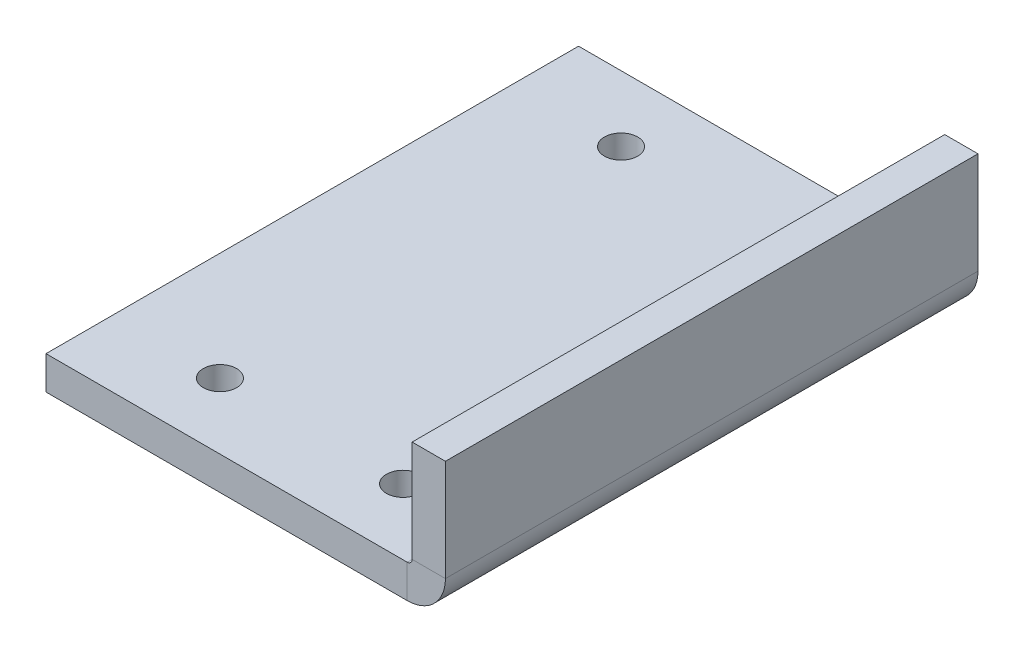
ISO-10303-21;
HEADER;
FILE_DESCRIPTION(('STEP AP214'),'2;1');
FILE_NAME('part.step','',(''),(''),'','','');
FILE_SCHEMA(('AUTOMOTIVE_DESIGN { 1 0 10303 214 1 1 1 1 }'));
ENDSEC;
DATA;
#1=APPLICATION_CONTEXT('core data for automotive mechanical design processes');
#2=APPLICATION_PROTOCOL_DEFINITION('international standard','automotive_design',2000,#1);
#3=PRODUCT_CONTEXT('',#1,'mechanical');
#4=PRODUCT('Part','Part','',(#3));
#5=PRODUCT_RELATED_PRODUCT_CATEGORY('part','',(#4));
#6=PRODUCT_DEFINITION_FORMATION('','',#4);
#7=PRODUCT_DEFINITION_CONTEXT('part definition',#1,'design');
#8=PRODUCT_DEFINITION('design','',#6,#7);
#9=PRODUCT_DEFINITION_SHAPE('','',#8);
#10=(LENGTH_UNIT() NAMED_UNIT(*) SI_UNIT(.MILLI.,.METRE.));
#11=(NAMED_UNIT(*) PLANE_ANGLE_UNIT() SI_UNIT($,.RADIAN.));
#12=(NAMED_UNIT(*) SI_UNIT($,.STERADIAN.) SOLID_ANGLE_UNIT());
#13=UNCERTAINTY_MEASURE_WITH_UNIT(LENGTH_MEASURE(1.E-05),#10,'distance_accuracy_value','');
#14=(GEOMETRIC_REPRESENTATION_CONTEXT(3) GLOBAL_UNCERTAINTY_ASSIGNED_CONTEXT((#13)) GLOBAL_UNIT_ASSIGNED_CONTEXT((#10,
#11,#12)) REPRESENTATION_CONTEXT('',''));
#15=CARTESIAN_POINT('',(0.,0.,0.));
#16=DIRECTION('',(0.,0.,1.));
#17=DIRECTION('',(1.,0.,0.));
#18=AXIS2_PLACEMENT_3D('',#15,#16,#17);
#19=CARTESIAN_POINT('',(-29.9999999999989,-5.00000000000095,-39.9999999999988));
#20=DIRECTION('',(0.,0.,-1.));
#21=DIRECTION('',(-1.,0.,0.));
#22=AXIS2_PLACEMENT_3D('',#19,#20,#21);
#23=PLANE('',#22);
#24=DIRECTION('',(-1.,0.,0.));
#25=VECTOR('',#24,1.);
#26=CARTESIAN_POINT('',(-29.9999999999998,-6.66133814775094E-13,-39.9999999999994));
#27=LINE('',#26,#25);
#28=CARTESIAN_POINT('',(24.2634000000021,-1.72084568816899E-12,-39.9999999999979));
#29=VERTEX_POINT('',#28);
#30=CARTESIAN_POINT('',(-29.9999999999998,-6.66133814775094E-13,-39.9999999999994));
#31=VERTEX_POINT('',#30);
#32=EDGE_CURVE('E110',#29,#31,#27,.T.);
#33=ORIENTED_EDGE('',*,*,#32,.F.);
#34=DIRECTION('',(0.,-0.999999999999999,0.));
#35=VECTOR('',#34,1.);
#36=CARTESIAN_POINT('',(24.2634000000021,-1.72084568816899E-12,-39.9999999999979));
#37=LINE('',#36,#35);
#38=CARTESIAN_POINT('',(24.2633999999999,-5.00000000000023,-40.0000000000001));
#39=VERTEX_POINT('',#38);
#40=EDGE_CURVE('E123',#29,#39,#37,.T.);
#41=ORIENTED_EDGE('',*,*,#40,.T.);
#42=DIRECTION('',(-1.,0.,0.));
#43=VECTOR('',#42,1.);
#44=CARTESIAN_POINT('',(-29.9999999999989,-5.00000000000095,-39.9999999999988));
#45=LINE('',#44,#43);
#46=CARTESIAN_POINT('',(-29.9999999999989,-5.00000000000095,-39.9999999999988));
#47=VERTEX_POINT('',#46);
#48=EDGE_CURVE('E115',#39,#47,#45,.T.);
#49=ORIENTED_EDGE('',*,*,#48,.T.);
#50=DIRECTION('',(0.,0.999999999999999,0.));
#51=VECTOR('',#50,1.);
#52=CARTESIAN_POINT('',(-29.9999999999989,-5.00000000000095,-39.9999999999988));
#53=LINE('',#52,#51);
#54=EDGE_CURVE('E65',#47,#31,#53,.T.);
#55=ORIENTED_EDGE('',*,*,#54,.T.);
#56=EDGE_LOOP('',(#33,#41,#49,#55));
#57=FACE_BOUND('',#56,.T.);
#58=ADVANCED_FACE('F62',(#57),#23,.T.);
#59=CARTESIAN_POINT('',(6.10622663543836E-13,-5.00000000000056,9.43689570931383E-13));
#60=DIRECTION('',(0.,-0.999999999999999,0.));
#61=DIRECTION('',(0.,0.,-1.));
#62=AXIS2_PLACEMENT_3D('',#59,#60,#61);
#63=PLANE('',#62);
#64=CARTESIAN_POINT('',(-13.7499999999984,-5.00000000000123,30.1200000000032));
#65=DIRECTION('',(0.,-0.999999999999999,0.));
#66=DIRECTION('',(0.,0.,-1.));
#67=AXIS2_PLACEMENT_3D('',#64,#65,#66);
#68=CIRCLE('',#67,2.5);
#69=CARTESIAN_POINT('',(-13.7499999999984,-5.00000000000123,27.6200000000032));
#70=VERTEX_POINT('',#69);
#71=EDGE_CURVE('E185',#70,#70,#68,.F.);
#72=ORIENTED_EDGE('',*,*,#71,.T.);
#73=EDGE_LOOP('',(#72));
#74=FACE_BOUND('',#73,.T.);
#75=CARTESIAN_POINT('',(13.7500000000019,-5.00000000000089,30.1200000000029));
#76=DIRECTION('',(0.,-0.999999999999999,0.));
#77=DIRECTION('',(0.,0.,-1.));
#78=AXIS2_PLACEMENT_3D('',#75,#76,#77);
#79=CIRCLE('',#78,2.5);
#80=CARTESIAN_POINT('',(13.7500000000019,-5.00000000000089,27.6200000000029));
#81=VERTEX_POINT('',#80);
#82=EDGE_CURVE('E192',#81,#81,#79,.F.);
#83=ORIENTED_EDGE('',*,*,#82,.T.);
#84=EDGE_LOOP('',(#83));
#85=FACE_BOUND('',#84,.T.);
#86=CARTESIAN_POINT('',(13.7500000000009,-5.00000000000139,-30.1299999999975));
#87=DIRECTION('',(0.,-0.999999999999999,0.));
#88=DIRECTION('',(0.,0.,-1.));
#89=AXIS2_PLACEMENT_3D('',#86,#87,#88);
#90=CIRCLE('',#89,2.5);
#91=CARTESIAN_POINT('',(13.7500000000009,-5.00000000000139,-32.6299999999976));
#92=VERTEX_POINT('',#91);
#93=EDGE_CURVE('E184',#92,#92,#90,.F.);
#94=ORIENTED_EDGE('',*,*,#93,.T.);
#95=EDGE_LOOP('',(#94));
#96=FACE_BOUND('',#95,.T.);
#97=CARTESIAN_POINT('',(-13.7500000000001,-5.00000000000067,-30.1299999999994));
#98=DIRECTION('',(0.,-0.999999999999999,0.));
#99=DIRECTION('',(0.,0.,-1.));
#100=AXIS2_PLACEMENT_3D('',#97,#98,#99);
#101=CIRCLE('',#100,2.5);
#102=CARTESIAN_POINT('',(-13.7500000000001,-5.00000000000067,-32.6299999999994));
#103=VERTEX_POINT('',#102);
#104=EDGE_CURVE('E148',#103,#103,#101,.F.);
#105=ORIENTED_EDGE('',*,*,#104,.T.);
#106=EDGE_LOOP('',(#105));
#107=FACE_BOUND('',#106,.T.);
#108=ORIENTED_EDGE('',*,*,#48,.F.);
#109=DIRECTION('',(0.,0.,-1.));
#110=VECTOR('',#109,1.);
#111=CARTESIAN_POINT('',(24.2633999999999,-5.00000000000023,-40.0000000000001));
#112=LINE('',#111,#110);
#113=CARTESIAN_POINT('',(24.2634000000007,-5.00000000000134,40.0000000000032));
#114=VERTEX_POINT('',#113);
#115=EDGE_CURVE('E140',#39,#114,#112,.F.);
#116=ORIENTED_EDGE('',*,*,#115,.T.);
#117=DIRECTION('',(1.,0.,0.));
#118=VECTOR('',#117,1.);
#119=CARTESIAN_POINT('',(-29.9999999999977,-5.00000000000111,40.0000000000027));
#120=LINE('',#119,#118);
#121=CARTESIAN_POINT('',(-29.9999999999977,-5.00000000000111,40.0000000000027));
#122=VERTEX_POINT('',#121);
#123=EDGE_CURVE('E120',#122,#114,#120,.T.);
#124=ORIENTED_EDGE('',*,*,#123,.F.);
#125=DIRECTION('',(0.,0.,1.));
#126=VECTOR('',#125,1.);
#127=CARTESIAN_POINT('',(-29.9999999999977,-5.00000000000111,40.0000000000027));
#128=LINE('',#127,#126);
#129=EDGE_CURVE('E100',#47,#122,#128,.T.);
#130=ORIENTED_EDGE('',*,*,#129,.F.);
#131=EDGE_LOOP('',(#108,#116,#124,#130));
#132=FACE_BOUND('',#131,.T.);
#133=ADVANCED_FACE('F208',(#74,#85,#96,#107,#132),#63,.T.);
#134=CARTESIAN_POINT('',(0.,0.,0.));
#135=DIRECTION('',(0.,-0.999999999999999,0.));
#136=DIRECTION('',(0.,0.,-1.));
#137=AXIS2_PLACEMENT_3D('',#134,#135,#136);
#138=PLANE('',#137);
#139=CARTESIAN_POINT('',(-13.7499999999982,-1.16573417585641E-12,30.1200000000032));
#140=DIRECTION('',(0.,0.999999999999999,0.));
#141=DIRECTION('',(0.,0.,1.));
#142=AXIS2_PLACEMENT_3D('',#139,#140,#141);
#143=CIRCLE('',#142,2.5);
#144=CARTESIAN_POINT('',(-13.7499999999982,-1.16504028646602E-12,32.6200000000032));
#145=VERTEX_POINT('',#144);
#146=EDGE_CURVE('E189',#145,#145,#143,.T.);
#147=ORIENTED_EDGE('',*,*,#146,.F.);
#148=EDGE_LOOP('',(#147));
#149=FACE_BOUND('',#148,.T.);
#150=CARTESIAN_POINT('',(13.7500000000018,-1.22124532708767E-12,30.120000000003));
#151=DIRECTION('',(0.,0.999999999999999,0.));
#152=DIRECTION('',(0.,0.,1.));
#153=AXIS2_PLACEMENT_3D('',#150,#151,#152);
#154=CIRCLE('',#153,2.5);
#155=CARTESIAN_POINT('',(13.7500000000018,-1.22055143769728E-12,32.620000000003));
#156=VERTEX_POINT('',#155);
#157=EDGE_CURVE('E188',#156,#156,#154,.T.);
#158=ORIENTED_EDGE('',*,*,#157,.F.);
#159=EDGE_LOOP('',(#158));
#160=FACE_BOUND('',#159,.T.);
#161=CARTESIAN_POINT('',(13.7500000000003,-8.32667268468867E-13,-30.1299999999997));
#162=DIRECTION('',(0.,0.999999999999999,0.));
#163=DIRECTION('',(0.,0.,1.));
#164=AXIS2_PLACEMENT_3D('',#161,#162,#163);
#165=CIRCLE('',#164,2.5);
#166=CARTESIAN_POINT('',(13.7500000000003,-8.31973379078477E-13,-27.6299999999997));
#167=VERTEX_POINT('',#166);
#168=EDGE_CURVE('E195',#167,#167,#165,.T.);
#169=ORIENTED_EDGE('',*,*,#168,.F.);
#170=EDGE_LOOP('',(#169));
#171=FACE_BOUND('',#170,.T.);
#172=CARTESIAN_POINT('',(-13.75,-7.21644966006352E-13,-30.1299999999993));
#173=DIRECTION('',(0.,0.999999999999999,0.));
#174=DIRECTION('',(0.,0.,1.));
#175=AXIS2_PLACEMENT_3D('',#172,#173,#174);
#176=CIRCLE('',#175,2.5);
#177=CARTESIAN_POINT('',(-13.75,-7.20951076615961E-13,-27.6299999999993));
#178=VERTEX_POINT('',#177);
#179=EDGE_CURVE('E181',#178,#178,#176,.T.);
#180=ORIENTED_EDGE('',*,*,#179,.F.);
#181=EDGE_LOOP('',(#180));
#182=FACE_BOUND('',#181,.T.);
#183=DIRECTION('',(0.,0.,-1.));
#184=VECTOR('',#183,1.);
#185=CARTESIAN_POINT('',(24.2634000000021,-1.72084568816899E-12,-39.9999999999979));
#186=LINE('',#185,#184);
#187=CARTESIAN_POINT('',(24.2634000000001,-7.7715611723761E-13,40.0000000000017));
#188=VERTEX_POINT('',#187);
#189=EDGE_CURVE('E130',#29,#188,#186,.F.);
#190=ORIENTED_EDGE('',*,*,#189,.F.);
#191=ORIENTED_EDGE('',*,*,#32,.T.);
#192=DIRECTION('',(0.,0.,1.));
#193=VECTOR('',#192,1.);
#194=CARTESIAN_POINT('',(-29.9999999999986,-1.55431223447522E-12,40.000000000003));
#195=LINE('',#194,#193);
#196=CARTESIAN_POINT('',(-29.9999999999986,-1.55431223447522E-12,40.000000000003));
#197=VERTEX_POINT('',#196);
#198=EDGE_CURVE('E98',#31,#197,#195,.T.);
#199=ORIENTED_EDGE('',*,*,#198,.T.);
#200=DIRECTION('',(1.,0.,0.));
#201=VECTOR('',#200,1.);
#202=CARTESIAN_POINT('',(-29.9999999999986,-1.55431223447522E-12,40.000000000003));
#203=LINE('',#202,#201);
#204=EDGE_CURVE('E107',#197,#188,#203,.T.);
#205=ORIENTED_EDGE('',*,*,#204,.T.);
#206=EDGE_LOOP('',(#190,#191,#199,#205));
#207=FACE_BOUND('',#206,.T.);
#208=ADVANCED_FACE('F105',(#149,#160,#171,#182,#207),#138,.F.);
#209=CARTESIAN_POINT('',(-29.9999999999977,-5.00000000000111,40.0000000000027));
#210=DIRECTION('',(0.,0.,1.));
#211=DIRECTION('',(1.,0.,0.));
#212=AXIS2_PLACEMENT_3D('',#209,#210,#211);
#213=PLANE('',#212);
#214=DIRECTION('',(0.,-0.999999999999999,0.));
#215=VECTOR('',#214,1.);
#216=CARTESIAN_POINT('',(24.2634000000001,-7.7715611723761E-13,40.0000000000017));
#217=LINE('',#216,#215);
#218=EDGE_CURVE('E114',#188,#114,#217,.T.);
#219=ORIENTED_EDGE('',*,*,#218,.F.);
#220=ORIENTED_EDGE('',*,*,#204,.F.);
#221=DIRECTION('',(0.,0.999999999999999,0.));
#222=VECTOR('',#221,1.);
#223=CARTESIAN_POINT('',(-29.9999999999977,-5.00000000000111,40.0000000000027));
#224=LINE('',#223,#222);
#225=EDGE_CURVE('E13',#122,#197,#224,.T.);
#226=ORIENTED_EDGE('',*,*,#225,.F.);
#227=ORIENTED_EDGE('',*,*,#123,.T.);
#228=EDGE_LOOP('',(#219,#220,#226,#227));
#229=FACE_BOUND('',#228,.T.);
#230=ADVANCED_FACE('F113',(#229),#213,.T.);
#231=CARTESIAN_POINT('',(-29.9999999999977,-5.00000000000111,40.0000000000027));
#232=DIRECTION('',(-1.,0.,0.));
#233=DIRECTION('',(0.,0.,1.));
#234=AXIS2_PLACEMENT_3D('',#231,#232,#233);
#235=PLANE('',#234);
#236=ORIENTED_EDGE('',*,*,#198,.F.);
#237=ORIENTED_EDGE('',*,*,#54,.F.);
#238=ORIENTED_EDGE('',*,*,#129,.T.);
#239=ORIENTED_EDGE('',*,*,#225,.T.);
#240=EDGE_LOOP('',(#236,#237,#238,#239));
#241=FACE_BOUND('',#240,.T.);
#242=ADVANCED_FACE('F96',(#241),#235,.T.);
#243=CARTESIAN_POINT('',(24.2634000000013,0.736599999999088,40.0000000000024));
#244=DIRECTION('',(0.,0.,1.));
#245=DIRECTION('',(1.,0.,0.));
#246=AXIS2_PLACEMENT_3D('',#243,#244,#245);
#247=PLANE('',#246);
#248=DIRECTION('',(-1.,0.,0.));
#249=VECTOR('',#248,1.);
#250=CARTESIAN_POINT('',(30.000000000001,0.736599999998644,40.0000000000033));
#251=LINE('',#250,#249);
#252=CARTESIAN_POINT('',(25.0000000000007,0.736599999999532,40.0000000000009));
#253=VERTEX_POINT('',#252);
#254=CARTESIAN_POINT('',(30.000000000001,0.736599999998644,40.0000000000033));
#255=VERTEX_POINT('',#254);
#256=EDGE_CURVE('E144',#253,#255,#251,.F.);
#257=ORIENTED_EDGE('',*,*,#256,.F.);
#258=CARTESIAN_POINT('',(24.2634000000013,0.736599999999088,40.0000000000024));
#259=DIRECTION('',(0.,0.,-1.));
#260=DIRECTION('',(-1.,0.,0.));
#261=AXIS2_PLACEMENT_3D('',#258,#259,#260);
#262=CIRCLE('',#261,0.7366);
#263=EDGE_CURVE('E134',#188,#253,#262,.F.);
#264=ORIENTED_EDGE('',*,*,#263,.F.);
#265=ORIENTED_EDGE('',*,*,#218,.T.);
#266=CARTESIAN_POINT('',(24.2634000000013,0.736599999999088,40.0000000000024));
#267=DIRECTION('',(0.,0.,-1.));
#268=DIRECTION('',(-1.,0.,0.));
#269=AXIS2_PLACEMENT_3D('',#266,#267,#268);
#270=CIRCLE('',#269,5.7366);
#271=EDGE_CURVE('E76',#114,#255,#270,.F.);
#272=ORIENTED_EDGE('',*,*,#271,.T.);
#273=EDGE_LOOP('',(#257,#264,#265,#272));
#274=FACE_BOUND('',#273,.T.);
#275=ADVANCED_FACE('F272',(#274),#247,.T.);
#276=CARTESIAN_POINT('',(24.2634000000009,0.736599999999255,-39.9999999999993));
#277=DIRECTION('',(0.,0.,1.));
#278=DIRECTION('',(1.,0.,0.));
#279=AXIS2_PLACEMENT_3D('',#276,#277,#278);
#280=PLANE('',#279);
#281=CARTESIAN_POINT('',(24.2634000000009,0.736599999999255,-39.9999999999993));
#282=DIRECTION('',(0.,0.,-1.));
#283=DIRECTION('',(-1.,0.,0.));
#284=AXIS2_PLACEMENT_3D('',#281,#282,#283);
#285=CIRCLE('',#284,0.7366);
#286=CARTESIAN_POINT('',(25.0000000000026,0.736599999998089,-39.9999999999983));
#287=VERTEX_POINT('',#286);
#288=EDGE_CURVE('E127',#287,#29,#285,.T.);
#289=ORIENTED_EDGE('',*,*,#288,.F.);
#290=DIRECTION('',(-1.,0.,0.));
#291=VECTOR('',#290,1.);
#292=CARTESIAN_POINT('',(25.0000000000026,0.736599999998089,-39.9999999999983));
#293=LINE('',#292,#291);
#294=CARTESIAN_POINT('',(30.0000000000004,0.736599999999477,-39.9999999999995));
#295=VERTEX_POINT('',#294);
#296=EDGE_CURVE('E151',#287,#295,#293,.F.);
#297=ORIENTED_EDGE('',*,*,#296,.T.);
#298=CARTESIAN_POINT('',(24.2634000000009,0.736599999999255,-39.9999999999993));
#299=DIRECTION('',(0.,0.,-1.));
#300=DIRECTION('',(-1.,0.,0.));
#301=AXIS2_PLACEMENT_3D('',#298,#299,#300);
#302=CIRCLE('',#301,5.7366);
#303=EDGE_CURVE('E137',#295,#39,#302,.T.);
#304=ORIENTED_EDGE('',*,*,#303,.T.);
#305=ORIENTED_EDGE('',*,*,#40,.F.);
#306=EDGE_LOOP('',(#289,#297,#304,#305));
#307=FACE_BOUND('',#306,.T.);
#308=ADVANCED_FACE('F232',(#307),#280,.F.);
#309=CARTESIAN_POINT('',(24.2634000000009,0.736599999999255,-39.9999999999993));
#310=DIRECTION('',(0.,0.,-1.));
#311=DIRECTION('',(1.,0.,0.));
#312=AXIS2_PLACEMENT_3D('',#309,#310,#311);
#313=CYLINDRICAL_SURFACE('',#312,5.7366);
#314=ORIENTED_EDGE('',*,*,#115,.F.);
#315=ORIENTED_EDGE('',*,*,#303,.F.);
#316=DIRECTION('',(0.,0.,-1.));
#317=VECTOR('',#316,1.);
#318=CARTESIAN_POINT('',(30.000000000001,0.736599999998644,40.0000000000033));
#319=LINE('',#318,#317);
#320=EDGE_CURVE('E154',#295,#255,#319,.F.);
#321=ORIENTED_EDGE('',*,*,#320,.T.);
#322=ORIENTED_EDGE('',*,*,#271,.F.);
#323=EDGE_LOOP('',(#314,#315,#321,#322));
#324=FACE_BOUND('',#323,.T.);
#325=ADVANCED_FACE('F269',(#324),#313,.T.);
#326=CARTESIAN_POINT('',(24.2634000000009,0.736599999999255,-39.9999999999993));
#327=DIRECTION('',(0.,0.,-1.));
#328=DIRECTION('',(1.,0.,0.));
#329=AXIS2_PLACEMENT_3D('',#326,#327,#328);
#330=CYLINDRICAL_SURFACE('',#329,0.7366);
#331=ORIENTED_EDGE('',*,*,#189,.T.);
#332=ORIENTED_EDGE('',*,*,#263,.T.);
#333=DIRECTION('',(0.,0.,-1.));
#334=VECTOR('',#333,1.);
#335=CARTESIAN_POINT('',(25.0000000000007,0.736599999999532,40.0000000000009));
#336=LINE('',#335,#334);
#337=EDGE_CURVE('E147',#253,#287,#336,.T.);
#338=ORIENTED_EDGE('',*,*,#337,.T.);
#339=ORIENTED_EDGE('',*,*,#288,.T.);
#340=EDGE_LOOP('',(#331,#332,#338,#339));
#341=FACE_BOUND('',#340,.T.);
#342=ADVANCED_FACE('F238',(#341),#330,.F.);
#343=CARTESIAN_POINT('',(30.0000000000017,-1.33226762955019E-12,40.0000000000026));
#344=DIRECTION('',(0.,0.,-1.));
#345=DIRECTION('',(-1.,0.,0.));
#346=AXIS2_PLACEMENT_3D('',#343,#344,#345);
#347=PLANE('',#346);
#348=ORIENTED_EDGE('',*,*,#256,.T.);
#349=DIRECTION('',(0.,-1.,0.));
#350=VECTOR('',#349,1.);
#351=CARTESIAN_POINT('',(30.0000000000015,-1.60982338570648E-12,40.0000000000032));
#352=LINE('',#351,#350);
#353=CARTESIAN_POINT('',(30.0000000000012,15.9999999999993,40.000000000001));
#354=VERTEX_POINT('',#353);
#355=EDGE_CURVE('E165',#354,#255,#352,.T.);
#356=ORIENTED_EDGE('',*,*,#355,.F.);
#357=DIRECTION('',(-1.,0.,0.));
#358=VECTOR('',#357,1.);
#359=CARTESIAN_POINT('',(30.0000000000012,15.9999999999993,40.000000000001));
#360=LINE('',#359,#358);
#361=CARTESIAN_POINT('',(25.000000000001,15.9999999999988,40.0000000000031));
#362=VERTEX_POINT('',#361);
#363=EDGE_CURVE('E174',#354,#362,#360,.T.);
#364=ORIENTED_EDGE('',*,*,#363,.T.);
#365=DIRECTION('',(0.,1.,0.));
#366=VECTOR('',#365,1.);
#367=CARTESIAN_POINT('',(25.0000000000009,-1.66533453693773E-12,40.0000000000034));
#368=LINE('',#367,#366);
#369=EDGE_CURVE('E156',#362,#253,#368,.F.);
#370=ORIENTED_EDGE('',*,*,#369,.T.);
#371=EDGE_LOOP('',(#348,#356,#364,#370));
#372=FACE_BOUND('',#371,.T.);
#373=ADVANCED_FACE('F252',(#372),#347,.F.);
#374=CARTESIAN_POINT('',(30.0000000000007,15.9999999999991,-39.9999999999993));
#375=DIRECTION('',(0.,0.,1.));
#376=DIRECTION('',(1.,0.,0.));
#377=AXIS2_PLACEMENT_3D('',#374,#375,#376);
#378=PLANE('',#377);
#379=ORIENTED_EDGE('',*,*,#296,.F.);
#380=DIRECTION('',(0.,-1.,0.));
#381=VECTOR('',#380,1.);
#382=CARTESIAN_POINT('',(25.0000000000015,15.9999999999986,-39.9999999999977));
#383=LINE('',#382,#381);
#384=CARTESIAN_POINT('',(25.0000000000015,15.9999999999986,-39.9999999999977));
#385=VERTEX_POINT('',#384);
#386=EDGE_CURVE('E159',#287,#385,#383,.F.);
#387=ORIENTED_EDGE('',*,*,#386,.T.);
#388=DIRECTION('',(-1.,0.,0.));
#389=VECTOR('',#388,1.);
#390=CARTESIAN_POINT('',(30.0000000000007,15.9999999999991,-39.9999999999993));
#391=LINE('',#390,#389);
#392=CARTESIAN_POINT('',(30.0000000000007,15.9999999999991,-39.9999999999993));
#393=VERTEX_POINT('',#392);
#394=EDGE_CURVE('E131',#393,#385,#391,.T.);
#395=ORIENTED_EDGE('',*,*,#394,.F.);
#396=DIRECTION('',(0.,1.,0.));
#397=VECTOR('',#396,1.);
#398=CARTESIAN_POINT('',(30.0000000000006,-3.33066907387547E-13,-39.9999999999998));
#399=LINE('',#398,#397);
#400=EDGE_CURVE('E168',#295,#393,#399,.T.);
#401=ORIENTED_EDGE('',*,*,#400,.F.);
#402=EDGE_LOOP('',(#379,#387,#395,#401));
#403=FACE_BOUND('',#402,.T.);
#404=ADVANCED_FACE('F343',(#403),#378,.F.);
#405=CARTESIAN_POINT('',(30.0000000000011,-1.16573417585641E-12,2.1094237467878E-12));
#406=DIRECTION('',(-1.,0.,0.));
#407=DIRECTION('',(0.,-1.,0.));
#408=AXIS2_PLACEMENT_3D('',#405,#406,#407);
#409=PLANE('',#408);
#410=ORIENTED_EDGE('',*,*,#320,.F.);
#411=ORIENTED_EDGE('',*,*,#400,.T.);
#412=DIRECTION('',(0.,0.,1.));
#413=VECTOR('',#412,1.);
#414=CARTESIAN_POINT('',(30.0000000000015,15.9999999999983,3.05311331771918E-12));
#415=LINE('',#414,#413);
#416=EDGE_CURVE('E171',#393,#354,#415,.T.);
#417=ORIENTED_EDGE('',*,*,#416,.T.);
#418=ORIENTED_EDGE('',*,*,#355,.T.);
#419=EDGE_LOOP('',(#410,#411,#417,#418));
#420=FACE_BOUND('',#419,.T.);
#421=ADVANCED_FACE('F353',(#420),#409,.F.);
#422=CARTESIAN_POINT('',(25.0000000000021,-1.55431223447522E-12,2.77555756156289E-12));
#423=DIRECTION('',(-1.,0.,0.));
#424=DIRECTION('',(0.,-1.,0.));
#425=AXIS2_PLACEMENT_3D('',#422,#423,#424);
#426=PLANE('',#425);
#427=ORIENTED_EDGE('',*,*,#386,.F.);
#428=ORIENTED_EDGE('',*,*,#337,.F.);
#429=ORIENTED_EDGE('',*,*,#369,.F.);
#430=DIRECTION('',(0.,0.,-1.));
#431=VECTOR('',#430,1.);
#432=CARTESIAN_POINT('',(25.000000000001,15.9999999999988,40.0000000000031));
#433=LINE('',#432,#431);
#434=EDGE_CURVE('E162',#385,#362,#433,.F.);
#435=ORIENTED_EDGE('',*,*,#434,.F.);
#436=EDGE_LOOP('',(#427,#428,#429,#435));
#437=FACE_BOUND('',#436,.T.);
#438=ADVANCED_FACE('F245',(#437),#426,.T.);
#439=CARTESIAN_POINT('',(30.0000000000012,15.9999999999993,40.000000000001));
#440=DIRECTION('',(0.,-1.,0.));
#441=DIRECTION('',(1.,0.,0.));
#442=AXIS2_PLACEMENT_3D('',#439,#440,#441);
#443=PLANE('',#442);
#444=ORIENTED_EDGE('',*,*,#434,.T.);
#445=ORIENTED_EDGE('',*,*,#363,.F.);
#446=ORIENTED_EDGE('',*,*,#416,.F.);
#447=ORIENTED_EDGE('',*,*,#394,.T.);
#448=EDGE_LOOP('',(#444,#445,#446,#447));
#449=FACE_BOUND('',#448,.T.);
#450=ADVANCED_FACE('F216',(#449),#443,.F.);
#451=CARTESIAN_POINT('',(-13.7499999999988,-12.0710678118661,-30.1299999999986));
#452=DIRECTION('',(0.,0.999999999999999,0.));
#453=DIRECTION('',(0.,0.,1.));
#454=AXIS2_PLACEMENT_3D('',#451,#452,#453);
#455=CYLINDRICAL_SURFACE('',#454,2.5);
#456=ORIENTED_EDGE('',*,*,#179,.T.);
#457=EDGE_LOOP('',(#456));
#458=FACE_BOUND('',#457,.T.);
#459=ORIENTED_EDGE('',*,*,#104,.F.);
#460=EDGE_LOOP('',(#459));
#461=FACE_BOUND('',#460,.T.);
#462=ADVANCED_FACE('F213',(#458,#461),#455,.F.);
#463=CARTESIAN_POINT('',(13.7500000000023,-12.0710678118673,-30.1299999999977));
#464=DIRECTION('',(0.,0.999999999999999,0.));
#465=DIRECTION('',(0.,0.,1.));
#466=AXIS2_PLACEMENT_3D('',#463,#464,#465);
#467=CYLINDRICAL_SURFACE('',#466,2.5);
#468=ORIENTED_EDGE('',*,*,#168,.T.);
#469=EDGE_LOOP('',(#468));
#470=FACE_BOUND('',#469,.T.);
#471=ORIENTED_EDGE('',*,*,#93,.F.);
#472=EDGE_LOOP('',(#471));
#473=FACE_BOUND('',#472,.T.);
#474=ADVANCED_FACE('F203',(#470,#473),#467,.F.);
#475=CARTESIAN_POINT('',(13.7500000000013,-12.0710678118661,30.120000000002));
#476=DIRECTION('',(0.,0.999999999999999,0.));
#477=DIRECTION('',(0.,0.,1.));
#478=AXIS2_PLACEMENT_3D('',#475,#476,#477);
#479=CYLINDRICAL_SURFACE('',#478,2.5);
#480=ORIENTED_EDGE('',*,*,#157,.T.);
#481=EDGE_LOOP('',(#480));
#482=FACE_BOUND('',#481,.T.);
#483=ORIENTED_EDGE('',*,*,#82,.F.);
#484=EDGE_LOOP('',(#483));
#485=FACE_BOUND('',#484,.T.);
#486=ADVANCED_FACE('F398',(#482,#485),#479,.F.);
#487=CARTESIAN_POINT('',(-13.7499999999985,-12.0710678118665,30.1200000000016));
#488=DIRECTION('',(0.,0.999999999999999,0.));
#489=DIRECTION('',(0.,0.,1.));
#490=AXIS2_PLACEMENT_3D('',#487,#488,#489);
#491=CYLINDRICAL_SURFACE('',#490,2.5);
#492=ORIENTED_EDGE('',*,*,#146,.T.);
#493=EDGE_LOOP('',(#492));
#494=FACE_BOUND('',#493,.T.);
#495=ORIENTED_EDGE('',*,*,#71,.F.);
#496=EDGE_LOOP('',(#495));
#497=FACE_BOUND('',#496,.T.);
#498=ADVANCED_FACE('F408',(#494,#497),#491,.F.);
#499=CLOSED_SHELL('',(#58,#133,#208,#230,#242,#275,#308,#325,#342,#373,#404,#421,#438,#450,#462,
#474,#486,#498));
#500=MANIFOLD_SOLID_BREP('B2',#499);
#501=ADVANCED_BREP_SHAPE_REPRESENTATION('',(#18,#500),#14);
#502=SHAPE_DEFINITION_REPRESENTATION(#9,#501);
ENDSEC;
END-ISO-10303-21;
